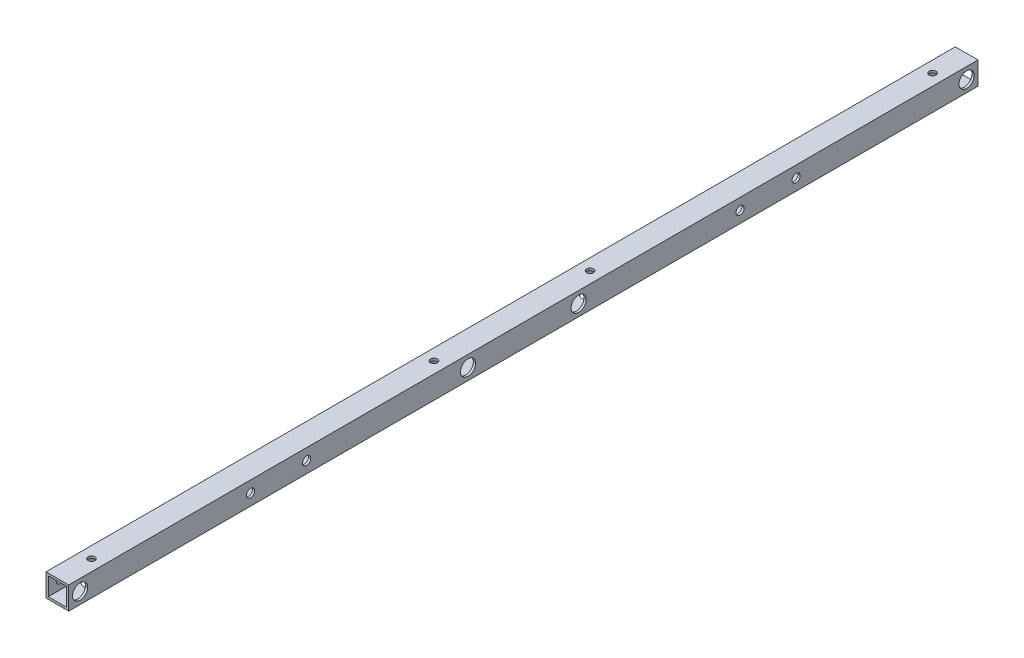
ISO-10303-21;
HEADER;
FILE_DESCRIPTION(('STEP AP214'),'2;1');
FILE_NAME('part.step','',(''),(''),'','','');
FILE_SCHEMA(('AUTOMOTIVE_DESIGN { 1 0 10303 214 1 1 1 1 }'));
ENDSEC;
DATA;
#1=APPLICATION_CONTEXT('core data for automotive mechanical design processes');
#2=APPLICATION_PROTOCOL_DEFINITION('international standard','automotive_design',2000,#1);
#3=PRODUCT_CONTEXT('',#1,'mechanical');
#4=PRODUCT('Part','Part','',(#3));
#5=PRODUCT_RELATED_PRODUCT_CATEGORY('part','',(#4));
#6=PRODUCT_DEFINITION_FORMATION('','',#4);
#7=PRODUCT_DEFINITION_CONTEXT('part definition',#1,'design');
#8=PRODUCT_DEFINITION('design','',#6,#7);
#9=PRODUCT_DEFINITION_SHAPE('','',#8);
#10=(LENGTH_UNIT() NAMED_UNIT(*) SI_UNIT(.MILLI.,.METRE.));
#11=(NAMED_UNIT(*) PLANE_ANGLE_UNIT() SI_UNIT($,.RADIAN.));
#12=(NAMED_UNIT(*) SI_UNIT($,.STERADIAN.) SOLID_ANGLE_UNIT());
#13=UNCERTAINTY_MEASURE_WITH_UNIT(LENGTH_MEASURE(1.E-05),#10,'distance_accuracy_value','');
#14=(GEOMETRIC_REPRESENTATION_CONTEXT(3) GLOBAL_UNCERTAINTY_ASSIGNED_CONTEXT((#13)) GLOBAL_UNIT_ASSIGNED_CONTEXT((#10,
#11,#12)) REPRESENTATION_CONTEXT('',''));
#15=CARTESIAN_POINT('',(0.,0.,0.));
#16=DIRECTION('',(0.,0.,1.));
#17=DIRECTION('',(1.,0.,0.));
#18=AXIS2_PLACEMENT_3D('',#15,#16,#17);
#19=CARTESIAN_POINT('',(0.,0.,600.));
#20=DIRECTION('',(0.,0.,-1.));
#21=DIRECTION('',(-1.,0.,0.));
#22=AXIS2_PLACEMENT_3D('',#19,#20,#21);
#23=PLANE('',#22);
#24=DIRECTION('',(0.,1.,0.));
#25=VECTOR('',#24,1.);
#26=CARTESIAN_POINT('',(7.5,-7.5,600.));
#27=LINE('',#26,#25);
#28=CARTESIAN_POINT('',(7.5,-7.5,600.));
#29=VERTEX_POINT('',#28);
#30=CARTESIAN_POINT('',(7.5,7.5,600.));
#31=VERTEX_POINT('',#30);
#32=EDGE_CURVE('E167',#29,#31,#27,.T.);
#33=ORIENTED_EDGE('',*,*,#32,.T.);
#34=DIRECTION('',(-1.,0.,0.));
#35=VECTOR('',#34,1.);
#36=CARTESIAN_POINT('',(-7.5,7.5,600.));
#37=LINE('',#36,#35);
#38=CARTESIAN_POINT('',(-7.5,7.5,600.));
#39=VERTEX_POINT('',#38);
#40=EDGE_CURVE('E171',#31,#39,#37,.T.);
#41=ORIENTED_EDGE('',*,*,#40,.T.);
#42=DIRECTION('',(0.,-1.,0.));
#43=VECTOR('',#42,1.);
#44=CARTESIAN_POINT('',(-7.5,-7.5,600.));
#45=LINE('',#44,#43);
#46=CARTESIAN_POINT('',(-7.5,-7.5,600.));
#47=VERTEX_POINT('',#46);
#48=EDGE_CURVE('E175',#39,#47,#45,.T.);
#49=ORIENTED_EDGE('',*,*,#48,.T.);
#50=DIRECTION('',(1.,0.,0.));
#51=VECTOR('',#50,1.);
#52=CARTESIAN_POINT('',(-7.5,-7.5,600.));
#53=LINE('',#52,#51);
#54=EDGE_CURVE('E178',#47,#29,#53,.T.);
#55=ORIENTED_EDGE('',*,*,#54,.T.);
#56=EDGE_LOOP('',(#33,#41,#49,#55));
#57=FACE_BOUND('',#56,.T.);
#58=DIRECTION('',(0.,1.,0.));
#59=VECTOR('',#58,1.);
#60=CARTESIAN_POINT('',(6.,-6.,600.));
#61=LINE('',#60,#59);
#62=CARTESIAN_POINT('',(6.,-6.,600.));
#63=VERTEX_POINT('',#62);
#64=CARTESIAN_POINT('',(6.,6.,600.));
#65=VERTEX_POINT('',#64);
#66=EDGE_CURVE('E115',#63,#65,#61,.T.);
#67=ORIENTED_EDGE('',*,*,#66,.F.);
#68=DIRECTION('',(1.,0.,0.));
#69=VECTOR('',#68,1.);
#70=CARTESIAN_POINT('',(-6.,-6.,600.));
#71=LINE('',#70,#69);
#72=CARTESIAN_POINT('',(-6.,-6.,600.));
#73=VERTEX_POINT('',#72);
#74=EDGE_CURVE('E143',#73,#63,#71,.T.);
#75=ORIENTED_EDGE('',*,*,#74,.F.);
#76=DIRECTION('',(0.,-1.,0.));
#77=VECTOR('',#76,1.);
#78=CARTESIAN_POINT('',(-6.,-6.,600.));
#79=LINE('',#78,#77);
#80=CARTESIAN_POINT('',(-6.,6.,600.));
#81=VERTEX_POINT('',#80);
#82=EDGE_CURVE('E137',#81,#73,#79,.T.);
#83=ORIENTED_EDGE('',*,*,#82,.F.);
#84=DIRECTION('',(-1.,0.,0.));
#85=VECTOR('',#84,1.);
#86=CARTESIAN_POINT('',(-6.,6.,600.));
#87=LINE('',#86,#85);
#88=EDGE_CURVE('E124',#65,#81,#87,.T.);
#89=ORIENTED_EDGE('',*,*,#88,.F.);
#90=EDGE_LOOP('',(#67,#75,#83,#89));
#91=FACE_BOUND('',#90,.T.);
#92=ADVANCED_FACE('F47',(#57,#91),#23,.F.);
#93=CARTESIAN_POINT('',(0.,0.,0.));
#94=DIRECTION('',(0.,0.,-1.));
#95=DIRECTION('',(-1.,0.,0.));
#96=AXIS2_PLACEMENT_3D('',#93,#94,#95);
#97=PLANE('',#96);
#98=DIRECTION('',(0.,1.,0.));
#99=VECTOR('',#98,1.);
#100=CARTESIAN_POINT('',(7.5,-7.5,0.));
#101=LINE('',#100,#99);
#102=CARTESIAN_POINT('',(7.5,-7.5,0.));
#103=VERTEX_POINT('',#102);
#104=CARTESIAN_POINT('',(7.5,7.5,0.));
#105=VERTEX_POINT('',#104);
#106=EDGE_CURVE('E133',#103,#105,#101,.T.);
#107=ORIENTED_EDGE('',*,*,#106,.F.);
#108=DIRECTION('',(1.,0.,0.));
#109=VECTOR('',#108,1.);
#110=CARTESIAN_POINT('',(-7.5,-7.5,0.));
#111=LINE('',#110,#109);
#112=CARTESIAN_POINT('',(-7.5,-7.5,0.));
#113=VERTEX_POINT('',#112);
#114=EDGE_CURVE('E172',#113,#103,#111,.T.);
#115=ORIENTED_EDGE('',*,*,#114,.F.);
#116=DIRECTION('',(0.,-1.,0.));
#117=VECTOR('',#116,1.);
#118=CARTESIAN_POINT('',(-7.5,-7.5,0.));
#119=LINE('',#118,#117);
#120=CARTESIAN_POINT('',(-7.5,7.5,0.));
#121=VERTEX_POINT('',#120);
#122=EDGE_CURVE('E188',#121,#113,#119,.T.);
#123=ORIENTED_EDGE('',*,*,#122,.F.);
#124=DIRECTION('',(-1.,0.,0.));
#125=VECTOR('',#124,1.);
#126=CARTESIAN_POINT('',(-7.5,7.5,0.));
#127=LINE('',#126,#125);
#128=EDGE_CURVE('E185',#105,#121,#127,.T.);
#129=ORIENTED_EDGE('',*,*,#128,.F.);
#130=EDGE_LOOP('',(#107,#115,#123,#129));
#131=FACE_BOUND('',#130,.T.);
#132=DIRECTION('',(1.,0.,0.));
#133=VECTOR('',#132,1.);
#134=CARTESIAN_POINT('',(-6.,-6.,0.));
#135=LINE('',#134,#133);
#136=CARTESIAN_POINT('',(-6.,-6.,0.));
#137=VERTEX_POINT('',#136);
#138=CARTESIAN_POINT('',(6.,-6.,0.));
#139=VERTEX_POINT('',#138);
#140=EDGE_CURVE('E125',#137,#139,#135,.T.);
#141=ORIENTED_EDGE('',*,*,#140,.T.);
#142=DIRECTION('',(0.,1.,0.));
#143=VECTOR('',#142,1.);
#144=CARTESIAN_POINT('',(6.,-6.,0.));
#145=LINE('',#144,#143);
#146=CARTESIAN_POINT('',(6.,6.,0.));
#147=VERTEX_POINT('',#146);
#148=EDGE_CURVE('E73',#139,#147,#145,.T.);
#149=ORIENTED_EDGE('',*,*,#148,.T.);
#150=DIRECTION('',(-1.,0.,0.));
#151=VECTOR('',#150,1.);
#152=CARTESIAN_POINT('',(-6.,6.,0.));
#153=LINE('',#152,#151);
#154=CARTESIAN_POINT('',(-6.,6.,0.));
#155=VERTEX_POINT('',#154);
#156=EDGE_CURVE('E131',#147,#155,#153,.T.);
#157=ORIENTED_EDGE('',*,*,#156,.T.);
#158=DIRECTION('',(0.,-1.,0.));
#159=VECTOR('',#158,1.);
#160=CARTESIAN_POINT('',(-6.,-6.,0.));
#161=LINE('',#160,#159);
#162=EDGE_CURVE('E154',#155,#137,#161,.T.);
#163=ORIENTED_EDGE('',*,*,#162,.T.);
#164=EDGE_LOOP('',(#141,#149,#157,#163));
#165=FACE_BOUND('',#164,.T.);
#166=ADVANCED_FACE('F404',(#131,#165),#97,.T.);
#167=CARTESIAN_POINT('',(7.5,-7.5,600.));
#168=DIRECTION('',(-1.,0.,0.));
#169=DIRECTION('',(0.,0.,1.));
#170=AXIS2_PLACEMENT_3D('',#167,#168,#169);
#171=PLANE('',#170);
#172=CARTESIAN_POINT('',(7.5,0.,120.));
#173=DIRECTION('',(-1.,0.,0.));
#174=DIRECTION('',(0.,0.,1.));
#175=AXIS2_PLACEMENT_3D('',#172,#173,#174);
#176=CIRCLE('',#175,2.7);
#177=CARTESIAN_POINT('',(7.5,0.,122.7));
#178=VERTEX_POINT('',#177);
#179=EDGE_CURVE('E299',#178,#178,#176,.T.);
#180=ORIENTED_EDGE('',*,*,#179,.T.);
#181=EDGE_LOOP('',(#180));
#182=FACE_BOUND('',#181,.T.);
#183=CARTESIAN_POINT('',(7.5,0.,157.));
#184=DIRECTION('',(-1.,0.,0.));
#185=DIRECTION('',(0.,0.,1.));
#186=AXIS2_PLACEMENT_3D('',#183,#184,#185);
#187=CIRCLE('',#186,2.7);
#188=CARTESIAN_POINT('',(7.5,0.,159.7));
#189=VERTEX_POINT('',#188);
#190=EDGE_CURVE('E290',#189,#189,#187,.T.);
#191=ORIENTED_EDGE('',*,*,#190,.T.);
#192=EDGE_LOOP('',(#191));
#193=FACE_BOUND('',#192,.T.);
#194=CARTESIAN_POINT('',(7.5,1.10883778837809E-12,443.));
#195=DIRECTION('',(-1.,0.,0.));
#196=DIRECTION('',(0.,0.,1.));
#197=AXIS2_PLACEMENT_3D('',#194,#195,#196);
#198=CIRCLE('',#197,2.69999999999999);
#199=CARTESIAN_POINT('',(7.5,1.10883778837809E-12,445.7));
#200=VERTEX_POINT('',#199);
#201=EDGE_CURVE('E282',#200,#200,#198,.T.);
#202=ORIENTED_EDGE('',*,*,#201,.T.);
#203=EDGE_LOOP('',(#202));
#204=FACE_BOUND('',#203,.T.);
#205=CARTESIAN_POINT('',(7.5,1.10883778837809E-12,480.));
#206=DIRECTION('',(-1.,0.,0.));
#207=DIRECTION('',(0.,0.,1.));
#208=AXIS2_PLACEMENT_3D('',#205,#206,#207);
#209=CIRCLE('',#208,2.69999999999999);
#210=CARTESIAN_POINT('',(7.5,1.10883778837809E-12,482.7));
#211=VERTEX_POINT('',#210);
#212=EDGE_CURVE('E275',#211,#211,#209,.T.);
#213=ORIENTED_EDGE('',*,*,#212,.T.);
#214=EDGE_LOOP('',(#213));
#215=FACE_BOUND('',#214,.T.);
#216=CARTESIAN_POINT('',(7.5,0.,592.5));
#217=DIRECTION('',(1.,0.,0.));
#218=DIRECTION('',(0.,0.,-1.));
#219=AXIS2_PLACEMENT_3D('',#216,#217,#218);
#220=CIRCLE('',#219,5.00000000000004);
#221=CARTESIAN_POINT('',(7.5,0.,587.5));
#222=VERTEX_POINT('',#221);
#223=EDGE_CURVE('E229',#222,#222,#220,.T.);
#224=ORIENTED_EDGE('',*,*,#223,.F.);
#225=EDGE_LOOP('',(#224));
#226=FACE_BOUND('',#225,.T.);
#227=CARTESIAN_POINT('',(7.5,0.,336.5));
#228=DIRECTION('',(1.,0.,0.));
#229=DIRECTION('',(0.,0.,-1.));
#230=AXIS2_PLACEMENT_3D('',#227,#228,#229);
#231=CIRCLE('',#230,4.99999999999999);
#232=CARTESIAN_POINT('',(7.5,0.,331.5));
#233=VERTEX_POINT('',#232);
#234=EDGE_CURVE('E329',#233,#233,#231,.T.);
#235=ORIENTED_EDGE('',*,*,#234,.F.);
#236=EDGE_LOOP('',(#235));
#237=FACE_BOUND('',#236,.T.);
#238=CARTESIAN_POINT('',(7.5,0.,263.5));
#239=DIRECTION('',(1.,0.,0.));
#240=DIRECTION('',(0.,0.,-1.));
#241=AXIS2_PLACEMENT_3D('',#238,#239,#240);
#242=CIRCLE('',#241,4.99999999999999);
#243=CARTESIAN_POINT('',(7.5,0.,258.5));
#244=VERTEX_POINT('',#243);
#245=EDGE_CURVE('E333',#244,#244,#242,.T.);
#246=ORIENTED_EDGE('',*,*,#245,.F.);
#247=EDGE_LOOP('',(#246));
#248=FACE_BOUND('',#247,.T.);
#249=CARTESIAN_POINT('',(7.5,0.,7.5));
#250=DIRECTION('',(1.,0.,0.));
#251=DIRECTION('',(0.,0.,-1.));
#252=AXIS2_PLACEMENT_3D('',#249,#250,#251);
#253=CIRCLE('',#252,5.);
#254=CARTESIAN_POINT('',(7.5,0.,2.5));
#255=VERTEX_POINT('',#254);
#256=EDGE_CURVE('E257',#255,#255,#253,.T.);
#257=ORIENTED_EDGE('',*,*,#256,.F.);
#258=EDGE_LOOP('',(#257));
#259=FACE_BOUND('',#258,.T.);
#260=ORIENTED_EDGE('',*,*,#106,.T.);
#261=DIRECTION('',(0.,0.,-1.));
#262=VECTOR('',#261,1.);
#263=CARTESIAN_POINT('',(7.5,7.5,600.));
#264=LINE('',#263,#262);
#265=EDGE_CURVE('E11',#31,#105,#264,.T.);
#266=ORIENTED_EDGE('',*,*,#265,.F.);
#267=ORIENTED_EDGE('',*,*,#32,.F.);
#268=DIRECTION('',(0.,0.,-1.));
#269=VECTOR('',#268,1.);
#270=CARTESIAN_POINT('',(7.5,-7.5,600.));
#271=LINE('',#270,#269);
#272=EDGE_CURVE('E181',#29,#103,#271,.T.);
#273=ORIENTED_EDGE('',*,*,#272,.T.);
#274=EDGE_LOOP('',(#260,#266,#267,#273));
#275=FACE_BOUND('',#274,.T.);
#276=ADVANCED_FACE('F49',(#182,#193,#204,#215,#226,#237,#248,#259,#275),#171,.F.);
#277=CARTESIAN_POINT('',(-7.5,7.5,600.));
#278=DIRECTION('',(0.,-1.,0.));
#279=DIRECTION('',(0.,0.,-1.));
#280=AXIS2_PLACEMENT_3D('',#277,#278,#279);
#281=PLANE('',#280);
#282=CARTESIAN_POINT('',(0.,7.5,577.5));
#283=DIRECTION('',(0.,1.,0.));
#284=DIRECTION('',(0.,0.,1.));
#285=AXIS2_PLACEMENT_3D('',#282,#283,#284);
#286=CIRCLE('',#285,2.24999999999998);
#287=CARTESIAN_POINT('',(0.,7.5,579.75));
#288=VERTEX_POINT('',#287);
#289=EDGE_CURVE('E346',#288,#288,#286,.T.);
#290=ORIENTED_EDGE('',*,*,#289,.F.);
#291=EDGE_LOOP('',(#290));
#292=FACE_BOUND('',#291,.T.);
#293=CARTESIAN_POINT('',(0.,7.5,22.5));
#294=DIRECTION('',(0.,1.,0.));
#295=DIRECTION('',(0.,0.,1.));
#296=AXIS2_PLACEMENT_3D('',#293,#294,#295);
#297=CIRCLE('',#296,2.25);
#298=CARTESIAN_POINT('',(0.,7.5,24.75));
#299=VERTEX_POINT('',#298);
#300=EDGE_CURVE('E352',#299,#299,#297,.T.);
#301=ORIENTED_EDGE('',*,*,#300,.F.);
#302=EDGE_LOOP('',(#301));
#303=FACE_BOUND('',#302,.T.);
#304=CARTESIAN_POINT('',(0.,7.5,351.5));
#305=DIRECTION('',(0.,1.,0.));
#306=DIRECTION('',(0.,0.,1.));
#307=AXIS2_PLACEMENT_3D('',#304,#305,#306);
#308=CIRCLE('',#307,2.25);
#309=CARTESIAN_POINT('',(0.,7.5,353.75));
#310=VERTEX_POINT('',#309);
#311=EDGE_CURVE('E347',#310,#310,#308,.T.);
#312=ORIENTED_EDGE('',*,*,#311,.F.);
#313=EDGE_LOOP('',(#312));
#314=FACE_BOUND('',#313,.T.);
#315=CARTESIAN_POINT('',(0.,7.5,248.5));
#316=DIRECTION('',(0.,1.,0.));
#317=DIRECTION('',(0.,0.,1.));
#318=AXIS2_PLACEMENT_3D('',#315,#316,#317);
#319=CIRCLE('',#318,2.25);
#320=CARTESIAN_POINT('',(0.,7.5,250.75));
#321=VERTEX_POINT('',#320);
#322=EDGE_CURVE('E351',#321,#321,#319,.T.);
#323=ORIENTED_EDGE('',*,*,#322,.F.);
#324=EDGE_LOOP('',(#323));
#325=FACE_BOUND('',#324,.T.);
#326=ORIENTED_EDGE('',*,*,#128,.T.);
#327=DIRECTION('',(0.,0.,-1.));
#328=VECTOR('',#327,1.);
#329=CARTESIAN_POINT('',(-7.5,7.5,600.));
#330=LINE('',#329,#328);
#331=EDGE_CURVE('E57',#39,#121,#330,.T.);
#332=ORIENTED_EDGE('',*,*,#331,.F.);
#333=ORIENTED_EDGE('',*,*,#40,.F.);
#334=ORIENTED_EDGE('',*,*,#265,.T.);
#335=EDGE_LOOP('',(#326,#332,#333,#334));
#336=FACE_BOUND('',#335,.T.);
#337=ADVANCED_FACE('F419',(#292,#303,#314,#325,#336),#281,.F.);
#338=CARTESIAN_POINT('',(-7.5,-7.5,600.));
#339=DIRECTION('',(1.,0.,0.));
#340=DIRECTION('',(0.,0.,-1.));
#341=AXIS2_PLACEMENT_3D('',#338,#339,#340);
#342=PLANE('',#341);
#343=CARTESIAN_POINT('',(-7.5,0.,120.));
#344=DIRECTION('',(-1.,0.,0.));
#345=DIRECTION('',(0.,0.,1.));
#346=AXIS2_PLACEMENT_3D('',#343,#344,#345);
#347=CIRCLE('',#346,5.);
#348=CARTESIAN_POINT('',(-7.5,0.,125.));
#349=VERTEX_POINT('',#348);
#350=EDGE_CURVE('E263',#349,#349,#347,.T.);
#351=ORIENTED_EDGE('',*,*,#350,.F.);
#352=EDGE_LOOP('',(#351));
#353=FACE_BOUND('',#352,.T.);
#354=CARTESIAN_POINT('',(-7.5,0.,157.));
#355=DIRECTION('',(-1.,0.,0.));
#356=DIRECTION('',(0.,0.,1.));
#357=AXIS2_PLACEMENT_3D('',#354,#355,#356);
#358=CIRCLE('',#357,4.99999999999999);
#359=CARTESIAN_POINT('',(-7.5,0.,162.));
#360=VERTEX_POINT('',#359);
#361=EDGE_CURVE('E577',#360,#360,#358,.T.);
#362=ORIENTED_EDGE('',*,*,#361,.F.);
#363=EDGE_LOOP('',(#362));
#364=FACE_BOUND('',#363,.T.);
#365=CARTESIAN_POINT('',(-7.5,1.10883778837809E-12,443.));
#366=DIRECTION('',(-1.,0.,0.));
#367=DIRECTION('',(0.,0.,1.));
#368=AXIS2_PLACEMENT_3D('',#365,#366,#367);
#369=CIRCLE('',#368,4.99999999999999);
#370=CARTESIAN_POINT('',(-7.5,1.10883778837809E-12,448.));
#371=VERTEX_POINT('',#370);
#372=EDGE_CURVE('E583',#371,#371,#369,.T.);
#373=ORIENTED_EDGE('',*,*,#372,.F.);
#374=EDGE_LOOP('',(#373));
#375=FACE_BOUND('',#374,.T.);
#376=CARTESIAN_POINT('',(-7.5,1.10883778837809E-12,480.));
#377=DIRECTION('',(-1.,0.,0.));
#378=DIRECTION('',(0.,0.,1.));
#379=AXIS2_PLACEMENT_3D('',#376,#377,#378);
#380=CIRCLE('',#379,4.99999999999999);
#381=CARTESIAN_POINT('',(-7.5,1.10883778837809E-12,485.));
#382=VERTEX_POINT('',#381);
#383=EDGE_CURVE('E589',#382,#382,#380,.T.);
#384=ORIENTED_EDGE('',*,*,#383,.F.);
#385=EDGE_LOOP('',(#384));
#386=FACE_BOUND('',#385,.T.);
#387=CARTESIAN_POINT('',(-7.5,0.,336.5));
#388=DIRECTION('',(1.,0.,0.));
#389=DIRECTION('',(0.,0.,-1.));
#390=AXIS2_PLACEMENT_3D('',#387,#388,#389);
#391=CIRCLE('',#390,2.24999999999995);
#392=CARTESIAN_POINT('',(-7.5,0.,334.25));
#393=VERTEX_POINT('',#392);
#394=EDGE_CURVE('E223',#393,#393,#391,.T.);
#395=ORIENTED_EDGE('',*,*,#394,.T.);
#396=EDGE_LOOP('',(#395));
#397=FACE_BOUND('',#396,.T.);
#398=CARTESIAN_POINT('',(-7.5,0.,263.5));
#399=DIRECTION('',(1.,0.,0.));
#400=DIRECTION('',(0.,0.,-1.));
#401=AXIS2_PLACEMENT_3D('',#398,#399,#400);
#402=CIRCLE('',#401,2.24999999999995);
#403=CARTESIAN_POINT('',(-7.5,0.,261.25));
#404=VERTEX_POINT('',#403);
#405=EDGE_CURVE('E217',#404,#404,#402,.T.);
#406=ORIENTED_EDGE('',*,*,#405,.T.);
#407=EDGE_LOOP('',(#406));
#408=FACE_BOUND('',#407,.T.);
#409=CARTESIAN_POINT('',(-7.5,0.,592.5));
#410=DIRECTION('',(1.,0.,0.));
#411=DIRECTION('',(0.,0.,-1.));
#412=AXIS2_PLACEMENT_3D('',#409,#410,#411);
#413=CIRCLE('',#412,2.25000000000001);
#414=CARTESIAN_POINT('',(-7.5,0.,590.25));
#415=VERTEX_POINT('',#414);
#416=EDGE_CURVE('E151',#415,#415,#413,.T.);
#417=ORIENTED_EDGE('',*,*,#416,.T.);
#418=EDGE_LOOP('',(#417));
#419=FACE_BOUND('',#418,.T.);
#420=CARTESIAN_POINT('',(-7.5,0.,7.5));
#421=DIRECTION('',(1.,0.,0.));
#422=DIRECTION('',(0.,0.,-1.));
#423=AXIS2_PLACEMENT_3D('',#420,#421,#422);
#424=CIRCLE('',#423,2.25);
#425=CARTESIAN_POINT('',(-7.5,0.,5.25));
#426=VERTEX_POINT('',#425);
#427=EDGE_CURVE('E207',#426,#426,#424,.T.);
#428=ORIENTED_EDGE('',*,*,#427,.T.);
#429=EDGE_LOOP('',(#428));
#430=FACE_BOUND('',#429,.T.);
#431=ORIENTED_EDGE('',*,*,#122,.T.);
#432=DIRECTION('',(0.,0.,-1.));
#433=VECTOR('',#432,1.);
#434=CARTESIAN_POINT('',(-7.5,-7.5,600.));
#435=LINE('',#434,#433);
#436=EDGE_CURVE('E196',#47,#113,#435,.T.);
#437=ORIENTED_EDGE('',*,*,#436,.F.);
#438=ORIENTED_EDGE('',*,*,#48,.F.);
#439=ORIENTED_EDGE('',*,*,#331,.T.);
#440=EDGE_LOOP('',(#431,#437,#438,#439));
#441=FACE_BOUND('',#440,.T.);
#442=ADVANCED_FACE('F385',(#353,#364,#375,#386,#397,#408,#419,#430,#441),#342,.F.);
#443=CARTESIAN_POINT('',(-7.5,-7.5,600.));
#444=DIRECTION('',(0.,1.,0.));
#445=DIRECTION('',(0.,0.,1.));
#446=AXIS2_PLACEMENT_3D('',#443,#444,#445);
#447=PLANE('',#446);
#448=CARTESIAN_POINT('',(0.,-7.5,577.5));
#449=DIRECTION('',(0.,-1.,0.));
#450=DIRECTION('',(0.,0.,-1.));
#451=AXIS2_PLACEMENT_3D('',#448,#449,#450);
#452=CIRCLE('',#451,5.);
#453=CARTESIAN_POINT('',(0.,-7.5,572.5));
#454=VERTEX_POINT('',#453);
#455=EDGE_CURVE('E245',#454,#454,#452,.T.);
#456=ORIENTED_EDGE('',*,*,#455,.F.);
#457=EDGE_LOOP('',(#456));
#458=FACE_BOUND('',#457,.T.);
#459=CARTESIAN_POINT('',(0.,-7.5,22.5));
#460=DIRECTION('',(0.,-1.,0.));
#461=DIRECTION('',(0.,0.,-1.));
#462=AXIS2_PLACEMENT_3D('',#459,#460,#461);
#463=CIRCLE('',#462,5.);
#464=CARTESIAN_POINT('',(0.,-7.5,17.5));
#465=VERTEX_POINT('',#464);
#466=EDGE_CURVE('E315',#465,#465,#463,.T.);
#467=ORIENTED_EDGE('',*,*,#466,.F.);
#468=EDGE_LOOP('',(#467));
#469=FACE_BOUND('',#468,.T.);
#470=CARTESIAN_POINT('',(0.,-7.5,248.5));
#471=DIRECTION('',(0.,-1.,0.));
#472=DIRECTION('',(0.,0.,-1.));
#473=AXIS2_PLACEMENT_3D('',#470,#471,#472);
#474=CIRCLE('',#473,5.);
#475=CARTESIAN_POINT('',(0.,-7.5,243.5));
#476=VERTEX_POINT('',#475);
#477=EDGE_CURVE('E319',#476,#476,#474,.T.);
#478=ORIENTED_EDGE('',*,*,#477,.F.);
#479=EDGE_LOOP('',(#478));
#480=FACE_BOUND('',#479,.T.);
#481=CARTESIAN_POINT('',(0.,-7.5,351.5));
#482=DIRECTION('',(0.,-1.,0.));
#483=DIRECTION('',(0.,0.,-1.));
#484=AXIS2_PLACEMENT_3D('',#481,#482,#483);
#485=CIRCLE('',#484,5.);
#486=CARTESIAN_POINT('',(0.,-7.5,346.5));
#487=VERTEX_POINT('',#486);
#488=EDGE_CURVE('E311',#487,#487,#485,.T.);
#489=ORIENTED_EDGE('',*,*,#488,.F.);
#490=EDGE_LOOP('',(#489));
#491=FACE_BOUND('',#490,.T.);
#492=ORIENTED_EDGE('',*,*,#114,.T.);
#493=ORIENTED_EDGE('',*,*,#272,.F.);
#494=ORIENTED_EDGE('',*,*,#54,.F.);
#495=ORIENTED_EDGE('',*,*,#436,.T.);
#496=EDGE_LOOP('',(#492,#493,#494,#495));
#497=FACE_BOUND('',#496,.T.);
#498=ADVANCED_FACE('F414',(#458,#469,#480,#491,#497),#447,.F.);
#499=CARTESIAN_POINT('',(6.,-6.,600.));
#500=DIRECTION('',(-1.,0.,0.));
#501=DIRECTION('',(0.,0.,1.));
#502=AXIS2_PLACEMENT_3D('',#499,#500,#501);
#503=PLANE('',#502);
#504=CARTESIAN_POINT('',(6.,0.,120.));
#505=DIRECTION('',(-1.,0.,0.));
#506=DIRECTION('',(0.,0.,1.));
#507=AXIS2_PLACEMENT_3D('',#504,#505,#506);
#508=CIRCLE('',#507,2.7);
#509=CARTESIAN_POINT('',(6.,0.,122.7));
#510=VERTEX_POINT('',#509);
#511=EDGE_CURVE('E307',#510,#510,#508,.F.);
#512=ORIENTED_EDGE('',*,*,#511,.T.);
#513=EDGE_LOOP('',(#512));
#514=FACE_BOUND('',#513,.T.);
#515=CARTESIAN_POINT('',(6.,0.,157.));
#516=DIRECTION('',(-1.,0.,0.));
#517=DIRECTION('',(0.,0.,1.));
#518=AXIS2_PLACEMENT_3D('',#515,#516,#517);
#519=CIRCLE('',#518,2.7);
#520=CARTESIAN_POINT('',(6.,0.,159.7));
#521=VERTEX_POINT('',#520);
#522=EDGE_CURVE('E303',#521,#521,#519,.F.);
#523=ORIENTED_EDGE('',*,*,#522,.T.);
#524=EDGE_LOOP('',(#523));
#525=FACE_BOUND('',#524,.T.);
#526=CARTESIAN_POINT('',(6.,1.10883778837809E-12,443.));
#527=DIRECTION('',(-1.,0.,0.));
#528=DIRECTION('',(0.,0.,1.));
#529=AXIS2_PLACEMENT_3D('',#526,#527,#528);
#530=CIRCLE('',#529,2.69999999999999);
#531=CARTESIAN_POINT('',(6.,1.10883778837809E-12,445.7));
#532=VERTEX_POINT('',#531);
#533=EDGE_CURVE('E298',#532,#532,#530,.F.);
#534=ORIENTED_EDGE('',*,*,#533,.T.);
#535=EDGE_LOOP('',(#534));
#536=FACE_BOUND('',#535,.T.);
#537=CARTESIAN_POINT('',(6.,1.10883778837809E-12,480.));
#538=DIRECTION('',(-1.,0.,0.));
#539=DIRECTION('',(0.,0.,1.));
#540=AXIS2_PLACEMENT_3D('',#537,#538,#539);
#541=CIRCLE('',#540,2.69999999999999);
#542=CARTESIAN_POINT('',(6.,1.10883778837809E-12,482.7));
#543=VERTEX_POINT('',#542);
#544=EDGE_CURVE('E294',#543,#543,#541,.F.);
#545=ORIENTED_EDGE('',*,*,#544,.T.);
#546=EDGE_LOOP('',(#545));
#547=FACE_BOUND('',#546,.T.);
#548=CARTESIAN_POINT('',(6.,0.,592.5));
#549=DIRECTION('',(-1.,0.,0.));
#550=DIRECTION('',(0.,0.,1.));
#551=AXIS2_PLACEMENT_3D('',#548,#549,#550);
#552=CIRCLE('',#551,5.00000000000004);
#553=CARTESIAN_POINT('',(6.,0.,597.5));
#554=VERTEX_POINT('',#553);
#555=EDGE_CURVE('E218',#554,#554,#552,.T.);
#556=ORIENTED_EDGE('',*,*,#555,.F.);
#557=EDGE_LOOP('',(#556));
#558=FACE_BOUND('',#557,.T.);
#559=CARTESIAN_POINT('',(6.,0.,336.5));
#560=DIRECTION('',(-1.,0.,0.));
#561=DIRECTION('',(0.,0.,1.));
#562=AXIS2_PLACEMENT_3D('',#559,#560,#561);
#563=CIRCLE('',#562,4.99999999999999);
#564=CARTESIAN_POINT('',(6.,0.,341.5));
#565=VERTEX_POINT('',#564);
#566=EDGE_CURVE('E233',#565,#565,#563,.T.);
#567=ORIENTED_EDGE('',*,*,#566,.F.);
#568=EDGE_LOOP('',(#567));
#569=FACE_BOUND('',#568,.T.);
#570=CARTESIAN_POINT('',(6.,0.,263.5));
#571=DIRECTION('',(-1.,0.,0.));
#572=DIRECTION('',(0.,0.,1.));
#573=AXIS2_PLACEMENT_3D('',#570,#571,#572);
#574=CIRCLE('',#573,4.99999999999999);
#575=CARTESIAN_POINT('',(6.,0.,268.5));
#576=VERTEX_POINT('',#575);
#577=EDGE_CURVE('E228',#576,#576,#574,.T.);
#578=ORIENTED_EDGE('',*,*,#577,.F.);
#579=EDGE_LOOP('',(#578));
#580=FACE_BOUND('',#579,.T.);
#581=CARTESIAN_POINT('',(6.,0.,7.5));
#582=DIRECTION('',(-1.,0.,0.));
#583=DIRECTION('',(0.,0.,1.));
#584=AXIS2_PLACEMENT_3D('',#581,#582,#583);
#585=CIRCLE('',#584,5.);
#586=CARTESIAN_POINT('',(6.,0.,12.5));
#587=VERTEX_POINT('',#586);
#588=EDGE_CURVE('E224',#587,#587,#585,.T.);
#589=ORIENTED_EDGE('',*,*,#588,.F.);
#590=EDGE_LOOP('',(#589));
#591=FACE_BOUND('',#590,.T.);
#592=ORIENTED_EDGE('',*,*,#148,.F.);
#593=DIRECTION('',(0.,0.,-1.));
#594=VECTOR('',#593,1.);
#595=CARTESIAN_POINT('',(6.,-6.,600.));
#596=LINE('',#595,#594);
#597=EDGE_CURVE('E119',#63,#139,#596,.T.);
#598=ORIENTED_EDGE('',*,*,#597,.F.);
#599=ORIENTED_EDGE('',*,*,#66,.T.);
#600=DIRECTION('',(0.,0.,-1.));
#601=VECTOR('',#600,1.);
#602=CARTESIAN_POINT('',(6.,6.,600.));
#603=LINE('',#602,#601);
#604=EDGE_CURVE('E118',#65,#147,#603,.T.);
#605=ORIENTED_EDGE('',*,*,#604,.T.);
#606=EDGE_LOOP('',(#592,#598,#599,#605));
#607=FACE_BOUND('',#606,.T.);
#608=ADVANCED_FACE('F117',(#514,#525,#536,#547,#558,#569,#580,#591,#607),#503,.T.);
#609=CARTESIAN_POINT('',(-6.,6.,600.));
#610=DIRECTION('',(0.,-1.,0.));
#611=DIRECTION('',(0.,0.,-1.));
#612=AXIS2_PLACEMENT_3D('',#609,#610,#611);
#613=PLANE('',#612);
#614=CARTESIAN_POINT('',(0.,6.,577.5));
#615=DIRECTION('',(0.,-1.,0.));
#616=DIRECTION('',(0.,0.,-1.));
#617=AXIS2_PLACEMENT_3D('',#614,#615,#616);
#618=CIRCLE('',#617,2.24999999999998);
#619=CARTESIAN_POINT('',(0.,6.,575.25));
#620=VERTEX_POINT('',#619);
#621=EDGE_CURVE('E208',#620,#620,#618,.T.);
#622=ORIENTED_EDGE('',*,*,#621,.F.);
#623=EDGE_LOOP('',(#622));
#624=FACE_BOUND('',#623,.T.);
#625=CARTESIAN_POINT('',(0.,6.,22.5));
#626=DIRECTION('',(0.,-1.,0.));
#627=DIRECTION('',(0.,0.,-1.));
#628=AXIS2_PLACEMENT_3D('',#625,#626,#627);
#629=CIRCLE('',#628,2.25);
#630=CARTESIAN_POINT('',(0.,6.,20.25));
#631=VERTEX_POINT('',#630);
#632=EDGE_CURVE('E370',#631,#631,#629,.T.);
#633=ORIENTED_EDGE('',*,*,#632,.F.);
#634=EDGE_LOOP('',(#633));
#635=FACE_BOUND('',#634,.T.);
#636=CARTESIAN_POINT('',(0.,6.,351.5));
#637=DIRECTION('',(0.,-1.,0.));
#638=DIRECTION('',(0.,0.,-1.));
#639=AXIS2_PLACEMENT_3D('',#636,#637,#638);
#640=CIRCLE('',#639,2.25);
#641=CARTESIAN_POINT('',(0.,6.,349.25));
#642=VERTEX_POINT('',#641);
#643=EDGE_CURVE('E366',#642,#642,#640,.T.);
#644=ORIENTED_EDGE('',*,*,#643,.F.);
#645=EDGE_LOOP('',(#644));
#646=FACE_BOUND('',#645,.T.);
#647=CARTESIAN_POINT('',(0.,6.,248.5));
#648=DIRECTION('',(0.,-1.,0.));
#649=DIRECTION('',(0.,0.,-1.));
#650=AXIS2_PLACEMENT_3D('',#647,#648,#649);
#651=CIRCLE('',#650,2.25);
#652=CARTESIAN_POINT('',(0.,6.,246.25));
#653=VERTEX_POINT('',#652);
#654=EDGE_CURVE('E362',#653,#653,#651,.T.);
#655=ORIENTED_EDGE('',*,*,#654,.F.);
#656=EDGE_LOOP('',(#655));
#657=FACE_BOUND('',#656,.T.);
#658=ORIENTED_EDGE('',*,*,#156,.F.);
#659=ORIENTED_EDGE('',*,*,#604,.F.);
#660=ORIENTED_EDGE('',*,*,#88,.T.);
#661=DIRECTION('',(0.,0.,-1.));
#662=VECTOR('',#661,1.);
#663=CARTESIAN_POINT('',(-6.,6.,600.));
#664=LINE('',#663,#662);
#665=EDGE_CURVE('E134',#81,#155,#664,.T.);
#666=ORIENTED_EDGE('',*,*,#665,.T.);
#667=EDGE_LOOP('',(#658,#659,#660,#666));
#668=FACE_BOUND('',#667,.T.);
#669=ADVANCED_FACE('F128',(#624,#635,#646,#657,#668),#613,.T.);
#670=CARTESIAN_POINT('',(-6.,-6.,600.));
#671=DIRECTION('',(1.,0.,0.));
#672=DIRECTION('',(0.,0.,-1.));
#673=AXIS2_PLACEMENT_3D('',#670,#671,#672);
#674=PLANE('',#673);
#675=CARTESIAN_POINT('',(-6.,0.,120.));
#676=DIRECTION('',(1.,0.,0.));
#677=DIRECTION('',(0.,0.,-1.));
#678=AXIS2_PLACEMENT_3D('',#675,#676,#677);
#679=CIRCLE('',#678,5.);
#680=CARTESIAN_POINT('',(-6.,0.,115.));
#681=VERTEX_POINT('',#680);
#682=EDGE_CURVE('E51',#681,#681,#679,.T.);
#683=ORIENTED_EDGE('',*,*,#682,.F.);
#684=EDGE_LOOP('',(#683));
#685=FACE_BOUND('',#684,.T.);
#686=CARTESIAN_POINT('',(-6.,0.,157.));
#687=DIRECTION('',(1.,0.,0.));
#688=DIRECTION('',(0.,0.,-1.));
#689=AXIS2_PLACEMENT_3D('',#686,#687,#688);
#690=CIRCLE('',#689,4.99999999999999);
#691=CARTESIAN_POINT('',(-6.,0.,152.));
#692=VERTEX_POINT('',#691);
#693=EDGE_CURVE('E266',#692,#692,#690,.T.);
#694=ORIENTED_EDGE('',*,*,#693,.F.);
#695=EDGE_LOOP('',(#694));
#696=FACE_BOUND('',#695,.T.);
#697=CARTESIAN_POINT('',(-6.,1.10883778837809E-12,443.));
#698=DIRECTION('',(1.,0.,0.));
#699=DIRECTION('',(0.,0.,-1.));
#700=AXIS2_PLACEMENT_3D('',#697,#698,#699);
#701=CIRCLE('',#700,4.99999999999999);
#702=CARTESIAN_POINT('',(-6.,1.10883778837809E-12,438.));
#703=VERTEX_POINT('',#702);
#704=EDGE_CURVE('E262',#703,#703,#701,.T.);
#705=ORIENTED_EDGE('',*,*,#704,.F.);
#706=EDGE_LOOP('',(#705));
#707=FACE_BOUND('',#706,.T.);
#708=CARTESIAN_POINT('',(-6.,1.10883778837809E-12,480.));
#709=DIRECTION('',(1.,0.,0.));
#710=DIRECTION('',(0.,0.,-1.));
#711=AXIS2_PLACEMENT_3D('',#708,#709,#710);
#712=CIRCLE('',#711,4.99999999999999);
#713=CARTESIAN_POINT('',(-6.,1.10883778837809E-12,475.));
#714=VERTEX_POINT('',#713);
#715=EDGE_CURVE('E258',#714,#714,#712,.T.);
#716=ORIENTED_EDGE('',*,*,#715,.F.);
#717=EDGE_LOOP('',(#716));
#718=FACE_BOUND('',#717,.T.);
#719=CARTESIAN_POINT('',(-6.,0.,336.5));
#720=DIRECTION('',(1.,0.,0.));
#721=DIRECTION('',(0.,0.,-1.));
#722=AXIS2_PLACEMENT_3D('',#719,#720,#721);
#723=CIRCLE('',#722,2.24999999999995);
#724=CARTESIAN_POINT('',(-6.,0.,334.25));
#725=VERTEX_POINT('',#724);
#726=EDGE_CURVE('E219',#725,#725,#723,.T.);
#727=ORIENTED_EDGE('',*,*,#726,.F.);
#728=EDGE_LOOP('',(#727));
#729=FACE_BOUND('',#728,.T.);
#730=CARTESIAN_POINT('',(-6.,0.,263.5));
#731=DIRECTION('',(1.,0.,0.));
#732=DIRECTION('',(0.,0.,-1.));
#733=AXIS2_PLACEMENT_3D('',#730,#731,#732);
#734=CIRCLE('',#733,2.24999999999995);
#735=CARTESIAN_POINT('',(-6.,0.,261.25));
#736=VERTEX_POINT('',#735);
#737=EDGE_CURVE('E213',#736,#736,#734,.T.);
#738=ORIENTED_EDGE('',*,*,#737,.F.);
#739=EDGE_LOOP('',(#738));
#740=FACE_BOUND('',#739,.T.);
#741=CARTESIAN_POINT('',(-6.,0.,592.5));
#742=DIRECTION('',(1.,0.,0.));
#743=DIRECTION('',(0.,0.,-1.));
#744=AXIS2_PLACEMENT_3D('',#741,#742,#743);
#745=CIRCLE('',#744,2.25000000000001);
#746=CARTESIAN_POINT('',(-6.,0.,590.25));
#747=VERTEX_POINT('',#746);
#748=EDGE_CURVE('E209',#747,#747,#745,.T.);
#749=ORIENTED_EDGE('',*,*,#748,.F.);
#750=EDGE_LOOP('',(#749));
#751=FACE_BOUND('',#750,.T.);
#752=CARTESIAN_POINT('',(-6.,0.,7.5));
#753=DIRECTION('',(1.,0.,0.));
#754=DIRECTION('',(0.,0.,-1.));
#755=AXIS2_PLACEMENT_3D('',#752,#753,#754);
#756=CIRCLE('',#755,2.25);
#757=CARTESIAN_POINT('',(-6.,0.,5.25));
#758=VERTEX_POINT('',#757);
#759=EDGE_CURVE('E203',#758,#758,#756,.T.);
#760=ORIENTED_EDGE('',*,*,#759,.F.);
#761=EDGE_LOOP('',(#760));
#762=FACE_BOUND('',#761,.T.);
#763=ORIENTED_EDGE('',*,*,#162,.F.);
#764=ORIENTED_EDGE('',*,*,#665,.F.);
#765=ORIENTED_EDGE('',*,*,#82,.T.);
#766=DIRECTION('',(0.,0.,-1.));
#767=VECTOR('',#766,1.);
#768=CARTESIAN_POINT('',(-6.,-6.,600.));
#769=LINE('',#768,#767);
#770=EDGE_CURVE('E65',#73,#137,#769,.T.);
#771=ORIENTED_EDGE('',*,*,#770,.T.);
#772=EDGE_LOOP('',(#763,#764,#765,#771));
#773=FACE_BOUND('',#772,.T.);
#774=ADVANCED_FACE('F450',(#685,#696,#707,#718,#729,#740,#751,#762,#773),#674,.T.);
#775=CARTESIAN_POINT('',(-6.,-6.,600.));
#776=DIRECTION('',(0.,1.,0.));
#777=DIRECTION('',(0.,0.,1.));
#778=AXIS2_PLACEMENT_3D('',#775,#776,#777);
#779=PLANE('',#778);
#780=CARTESIAN_POINT('',(0.,-6.,577.5));
#781=DIRECTION('',(0.,1.,0.));
#782=DIRECTION('',(0.,0.,1.));
#783=AXIS2_PLACEMENT_3D('',#780,#781,#782);
#784=CIRCLE('',#783,5.);
#785=CARTESIAN_POINT('',(0.,-6.,582.5));
#786=VERTEX_POINT('',#785);
#787=EDGE_CURVE('E253',#786,#786,#784,.T.);
#788=ORIENTED_EDGE('',*,*,#787,.F.);
#789=EDGE_LOOP('',(#788));
#790=FACE_BOUND('',#789,.T.);
#791=CARTESIAN_POINT('',(0.,-6.,22.5));
#792=DIRECTION('',(0.,1.,0.));
#793=DIRECTION('',(0.,0.,1.));
#794=AXIS2_PLACEMENT_3D('',#791,#792,#793);
#795=CIRCLE('',#794,5.);
#796=CARTESIAN_POINT('',(0.,-6.,27.5));
#797=VERTEX_POINT('',#796);
#798=EDGE_CURVE('E249',#797,#797,#795,.T.);
#799=ORIENTED_EDGE('',*,*,#798,.F.);
#800=EDGE_LOOP('',(#799));
#801=FACE_BOUND('',#800,.T.);
#802=CARTESIAN_POINT('',(0.,-6.,248.5));
#803=DIRECTION('',(0.,1.,0.));
#804=DIRECTION('',(0.,0.,1.));
#805=AXIS2_PLACEMENT_3D('',#802,#803,#804);
#806=CIRCLE('',#805,5.);
#807=CARTESIAN_POINT('',(0.,-6.,253.5));
#808=VERTEX_POINT('',#807);
#809=EDGE_CURVE('E244',#808,#808,#806,.T.);
#810=ORIENTED_EDGE('',*,*,#809,.F.);
#811=EDGE_LOOP('',(#810));
#812=FACE_BOUND('',#811,.T.);
#813=CARTESIAN_POINT('',(0.,-6.,351.5));
#814=DIRECTION('',(0.,1.,0.));
#815=DIRECTION('',(0.,0.,1.));
#816=AXIS2_PLACEMENT_3D('',#813,#814,#815);
#817=CIRCLE('',#816,5.);
#818=CARTESIAN_POINT('',(0.,-6.,356.5));
#819=VERTEX_POINT('',#818);
#820=EDGE_CURVE('E240',#819,#819,#817,.T.);
#821=ORIENTED_EDGE('',*,*,#820,.F.);
#822=EDGE_LOOP('',(#821));
#823=FACE_BOUND('',#822,.T.);
#824=ORIENTED_EDGE('',*,*,#140,.F.);
#825=ORIENTED_EDGE('',*,*,#770,.F.);
#826=ORIENTED_EDGE('',*,*,#74,.T.);
#827=ORIENTED_EDGE('',*,*,#597,.T.);
#828=EDGE_LOOP('',(#824,#825,#826,#827));
#829=FACE_BOUND('',#828,.T.);
#830=ADVANCED_FACE('F400',(#790,#801,#812,#823,#829),#779,.T.);
#831=CARTESIAN_POINT('',(-17.5,0.,7.5));
#832=DIRECTION('',(1.,0.,0.));
#833=DIRECTION('',(0.,0.,-1.));
#834=AXIS2_PLACEMENT_3D('',#831,#832,#833);
#835=CYLINDRICAL_SURFACE('',#834,2.25);
#836=ORIENTED_EDGE('',*,*,#759,.T.);
#837=EDGE_LOOP('',(#836));
#838=FACE_BOUND('',#837,.T.);
#839=ORIENTED_EDGE('',*,*,#427,.F.);
#840=EDGE_LOOP('',(#839));
#841=FACE_BOUND('',#840,.T.);
#842=ADVANCED_FACE('F391',(#838,#841),#835,.F.);
#843=CARTESIAN_POINT('',(-17.5,0.,592.5));
#844=DIRECTION('',(1.,0.,0.));
#845=DIRECTION('',(0.,0.,-1.));
#846=AXIS2_PLACEMENT_3D('',#843,#844,#845);
#847=CYLINDRICAL_SURFACE('',#846,2.25000000000001);
#848=ORIENTED_EDGE('',*,*,#748,.T.);
#849=EDGE_LOOP('',(#848));
#850=FACE_BOUND('',#849,.T.);
#851=ORIENTED_EDGE('',*,*,#416,.F.);
#852=EDGE_LOOP('',(#851));
#853=FACE_BOUND('',#852,.T.);
#854=ADVANCED_FACE('F388',(#850,#853),#847,.F.);
#855=CARTESIAN_POINT('',(0.,-17.5,248.5));
#856=DIRECTION('',(0.,1.,0.));
#857=DIRECTION('',(0.,0.,1.));
#858=AXIS2_PLACEMENT_3D('',#855,#856,#857);
#859=CYLINDRICAL_SURFACE('',#858,2.25);
#860=ORIENTED_EDGE('',*,*,#654,.T.);
#861=EDGE_LOOP('',(#860));
#862=FACE_BOUND('',#861,.T.);
#863=ORIENTED_EDGE('',*,*,#322,.T.);
#864=EDGE_LOOP('',(#863));
#865=FACE_BOUND('',#864,.T.);
#866=ADVANCED_FACE('F390',(#862,#865),#859,.F.);
#867=CARTESIAN_POINT('',(0.,-17.5,351.5));
#868=DIRECTION('',(0.,1.,0.));
#869=DIRECTION('',(0.,0.,1.));
#870=AXIS2_PLACEMENT_3D('',#867,#868,#869);
#871=CYLINDRICAL_SURFACE('',#870,2.25);
#872=ORIENTED_EDGE('',*,*,#643,.T.);
#873=EDGE_LOOP('',(#872));
#874=FACE_BOUND('',#873,.T.);
#875=ORIENTED_EDGE('',*,*,#311,.T.);
#876=EDGE_LOOP('',(#875));
#877=FACE_BOUND('',#876,.T.);
#878=ADVANCED_FACE('F397',(#874,#877),#871,.F.);
#879=CARTESIAN_POINT('',(0.,-17.5,22.5));
#880=DIRECTION('',(0.,1.,0.));
#881=DIRECTION('',(0.,0.,1.));
#882=AXIS2_PLACEMENT_3D('',#879,#880,#881);
#883=CYLINDRICAL_SURFACE('',#882,2.25);
#884=ORIENTED_EDGE('',*,*,#632,.T.);
#885=EDGE_LOOP('',(#884));
#886=FACE_BOUND('',#885,.T.);
#887=ORIENTED_EDGE('',*,*,#300,.T.);
#888=EDGE_LOOP('',(#887));
#889=FACE_BOUND('',#888,.T.);
#890=ADVANCED_FACE('F475',(#886,#889),#883,.F.);
#891=CARTESIAN_POINT('',(0.,-17.5,577.5));
#892=DIRECTION('',(0.,1.,0.));
#893=DIRECTION('',(0.,0.,1.));
#894=AXIS2_PLACEMENT_3D('',#891,#892,#893);
#895=CYLINDRICAL_SURFACE('',#894,2.24999999999998);
#896=ORIENTED_EDGE('',*,*,#621,.T.);
#897=EDGE_LOOP('',(#896));
#898=FACE_BOUND('',#897,.T.);
#899=ORIENTED_EDGE('',*,*,#289,.T.);
#900=EDGE_LOOP('',(#899));
#901=FACE_BOUND('',#900,.T.);
#902=ADVANCED_FACE('F479',(#898,#901),#895,.F.);
#903=CARTESIAN_POINT('',(-12.5,0.,263.5));
#904=DIRECTION('',(1.,0.,0.));
#905=DIRECTION('',(0.,0.,-1.));
#906=AXIS2_PLACEMENT_3D('',#903,#904,#905);
#907=CYLINDRICAL_SURFACE('',#906,2.24999999999995);
#908=ORIENTED_EDGE('',*,*,#737,.T.);
#909=EDGE_LOOP('',(#908));
#910=FACE_BOUND('',#909,.T.);
#911=ORIENTED_EDGE('',*,*,#405,.F.);
#912=EDGE_LOOP('',(#911));
#913=FACE_BOUND('',#912,.T.);
#914=ADVANCED_FACE('F483',(#910,#913),#907,.F.);
#915=CARTESIAN_POINT('',(-12.5,0.,336.5));
#916=DIRECTION('',(1.,0.,0.));
#917=DIRECTION('',(0.,0.,-1.));
#918=AXIS2_PLACEMENT_3D('',#915,#916,#917);
#919=CYLINDRICAL_SURFACE('',#918,2.24999999999995);
#920=ORIENTED_EDGE('',*,*,#726,.T.);
#921=EDGE_LOOP('',(#920));
#922=FACE_BOUND('',#921,.T.);
#923=ORIENTED_EDGE('',*,*,#394,.F.);
#924=EDGE_LOOP('',(#923));
#925=FACE_BOUND('',#924,.T.);
#926=ADVANCED_FACE('F490',(#922,#925),#919,.F.);
#927=CARTESIAN_POINT('',(-2.5,0.,7.5));
#928=DIRECTION('',(1.,0.,0.));
#929=DIRECTION('',(0.,0.,-1.));
#930=AXIS2_PLACEMENT_3D('',#927,#928,#929);
#931=CYLINDRICAL_SURFACE('',#930,5.);
#932=ORIENTED_EDGE('',*,*,#588,.T.);
#933=EDGE_LOOP('',(#932));
#934=FACE_BOUND('',#933,.T.);
#935=ORIENTED_EDGE('',*,*,#256,.T.);
#936=EDGE_LOOP('',(#935));
#937=FACE_BOUND('',#936,.T.);
#938=ADVANCED_FACE('F495',(#934,#937),#931,.F.);
#939=CARTESIAN_POINT('',(-2.5,0.,263.5));
#940=DIRECTION('',(1.,0.,0.));
#941=DIRECTION('',(0.,0.,-1.));
#942=AXIS2_PLACEMENT_3D('',#939,#940,#941);
#943=CYLINDRICAL_SURFACE('',#942,4.99999999999999);
#944=ORIENTED_EDGE('',*,*,#577,.T.);
#945=EDGE_LOOP('',(#944));
#946=FACE_BOUND('',#945,.T.);
#947=ORIENTED_EDGE('',*,*,#245,.T.);
#948=EDGE_LOOP('',(#947));
#949=FACE_BOUND('',#948,.T.);
#950=ADVANCED_FACE('F511',(#946,#949),#943,.F.);
#951=CARTESIAN_POINT('',(-2.5,0.,336.5));
#952=DIRECTION('',(1.,0.,0.));
#953=DIRECTION('',(0.,0.,-1.));
#954=AXIS2_PLACEMENT_3D('',#951,#952,#953);
#955=CYLINDRICAL_SURFACE('',#954,4.99999999999999);
#956=ORIENTED_EDGE('',*,*,#566,.T.);
#957=EDGE_LOOP('',(#956));
#958=FACE_BOUND('',#957,.T.);
#959=ORIENTED_EDGE('',*,*,#234,.T.);
#960=EDGE_LOOP('',(#959));
#961=FACE_BOUND('',#960,.T.);
#962=ADVANCED_FACE('F518',(#958,#961),#955,.F.);
#963=CARTESIAN_POINT('',(-2.5,0.,592.5));
#964=DIRECTION('',(1.,0.,0.));
#965=DIRECTION('',(0.,0.,-1.));
#966=AXIS2_PLACEMENT_3D('',#963,#964,#965);
#967=CYLINDRICAL_SURFACE('',#966,5.00000000000004);
#968=ORIENTED_EDGE('',*,*,#555,.T.);
#969=EDGE_LOOP('',(#968));
#970=FACE_BOUND('',#969,.T.);
#971=ORIENTED_EDGE('',*,*,#223,.T.);
#972=EDGE_LOOP('',(#971));
#973=FACE_BOUND('',#972,.T.);
#974=ADVANCED_FACE('F522',(#970,#973),#967,.F.);
#975=CARTESIAN_POINT('',(0.,2.5,351.5));
#976=DIRECTION('',(0.,-1.,0.));
#977=DIRECTION('',(0.,0.,-1.));
#978=AXIS2_PLACEMENT_3D('',#975,#976,#977);
#979=CYLINDRICAL_SURFACE('',#978,5.);
#980=ORIENTED_EDGE('',*,*,#820,.T.);
#981=EDGE_LOOP('',(#980));
#982=FACE_BOUND('',#981,.T.);
#983=ORIENTED_EDGE('',*,*,#488,.T.);
#984=EDGE_LOOP('',(#983));
#985=FACE_BOUND('',#984,.T.);
#986=ADVANCED_FACE('F526',(#982,#985),#979,.F.);
#987=CARTESIAN_POINT('',(0.,2.5,248.5));
#988=DIRECTION('',(0.,-1.,0.));
#989=DIRECTION('',(0.,0.,-1.));
#990=AXIS2_PLACEMENT_3D('',#987,#988,#989);
#991=CYLINDRICAL_SURFACE('',#990,5.);
#992=ORIENTED_EDGE('',*,*,#809,.T.);
#993=EDGE_LOOP('',(#992));
#994=FACE_BOUND('',#993,.T.);
#995=ORIENTED_EDGE('',*,*,#477,.T.);
#996=EDGE_LOOP('',(#995));
#997=FACE_BOUND('',#996,.T.);
#998=ADVANCED_FACE('F530',(#994,#997),#991,.F.);
#999=CARTESIAN_POINT('',(0.,2.5,22.5));
#1000=DIRECTION('',(0.,-1.,0.));
#1001=DIRECTION('',(0.,0.,-1.));
#1002=AXIS2_PLACEMENT_3D('',#999,#1000,#1001);
#1003=CYLINDRICAL_SURFACE('',#1002,5.);
#1004=ORIENTED_EDGE('',*,*,#798,.T.);
#1005=EDGE_LOOP('',(#1004));
#1006=FACE_BOUND('',#1005,.T.);
#1007=ORIENTED_EDGE('',*,*,#466,.T.);
#1008=EDGE_LOOP('',(#1007));
#1009=FACE_BOUND('',#1008,.T.);
#1010=ADVANCED_FACE('F534',(#1006,#1009),#1003,.F.);
#1011=CARTESIAN_POINT('',(0.,2.5,577.5));
#1012=DIRECTION('',(0.,-1.,0.));
#1013=DIRECTION('',(0.,0.,-1.));
#1014=AXIS2_PLACEMENT_3D('',#1011,#1012,#1013);
#1015=CYLINDRICAL_SURFACE('',#1014,5.);
#1016=ORIENTED_EDGE('',*,*,#787,.T.);
#1017=EDGE_LOOP('',(#1016));
#1018=FACE_BOUND('',#1017,.T.);
#1019=ORIENTED_EDGE('',*,*,#455,.T.);
#1020=EDGE_LOOP('',(#1019));
#1021=FACE_BOUND('',#1020,.T.);
#1022=ADVANCED_FACE('F538',(#1018,#1021),#1015,.F.);
#1023=CARTESIAN_POINT('',(-22.5,1.10883778837809E-12,480.));
#1024=DIRECTION('',(1.,0.,0.));
#1025=DIRECTION('',(0.,0.,-1.));
#1026=AXIS2_PLACEMENT_3D('',#1023,#1024,#1025);
#1027=CYLINDRICAL_SURFACE('',#1026,2.69999999999999);
#1028=ORIENTED_EDGE('',*,*,#544,.F.);
#1029=EDGE_LOOP('',(#1028));
#1030=FACE_BOUND('',#1029,.T.);
#1031=ORIENTED_EDGE('',*,*,#212,.F.);
#1032=EDGE_LOOP('',(#1031));
#1033=FACE_BOUND('',#1032,.T.);
#1034=ADVANCED_FACE('F542',(#1030,#1033),#1027,.F.);
#1035=CARTESIAN_POINT('',(-22.5,1.10883778837809E-12,443.));
#1036=DIRECTION('',(1.,0.,0.));
#1037=DIRECTION('',(0.,0.,-1.));
#1038=AXIS2_PLACEMENT_3D('',#1035,#1036,#1037);
#1039=CYLINDRICAL_SURFACE('',#1038,2.69999999999999);
#1040=ORIENTED_EDGE('',*,*,#533,.F.);
#1041=EDGE_LOOP('',(#1040));
#1042=FACE_BOUND('',#1041,.T.);
#1043=ORIENTED_EDGE('',*,*,#201,.F.);
#1044=EDGE_LOOP('',(#1043));
#1045=FACE_BOUND('',#1044,.T.);
#1046=ADVANCED_FACE('F546',(#1042,#1045),#1039,.F.);
#1047=CARTESIAN_POINT('',(-22.5,0.,157.));
#1048=DIRECTION('',(1.,0.,0.));
#1049=DIRECTION('',(0.,0.,-1.));
#1050=AXIS2_PLACEMENT_3D('',#1047,#1048,#1049);
#1051=CYLINDRICAL_SURFACE('',#1050,2.7);
#1052=ORIENTED_EDGE('',*,*,#522,.F.);
#1053=EDGE_LOOP('',(#1052));
#1054=FACE_BOUND('',#1053,.T.);
#1055=ORIENTED_EDGE('',*,*,#190,.F.);
#1056=EDGE_LOOP('',(#1055));
#1057=FACE_BOUND('',#1056,.T.);
#1058=ADVANCED_FACE('F550',(#1054,#1057),#1051,.F.);
#1059=CARTESIAN_POINT('',(-22.5,0.,120.));
#1060=DIRECTION('',(1.,0.,0.));
#1061=DIRECTION('',(0.,0.,-1.));
#1062=AXIS2_PLACEMENT_3D('',#1059,#1060,#1061);
#1063=CYLINDRICAL_SURFACE('',#1062,2.7);
#1064=ORIENTED_EDGE('',*,*,#511,.F.);
#1065=EDGE_LOOP('',(#1064));
#1066=FACE_BOUND('',#1065,.T.);
#1067=ORIENTED_EDGE('',*,*,#179,.F.);
#1068=EDGE_LOOP('',(#1067));
#1069=FACE_BOUND('',#1068,.T.);
#1070=ADVANCED_FACE('F554',(#1066,#1069),#1063,.F.);
#1071=CARTESIAN_POINT('',(-2.5,1.10883778837809E-12,480.));
#1072=DIRECTION('',(-1.,0.,0.));
#1073=DIRECTION('',(0.,0.,1.));
#1074=AXIS2_PLACEMENT_3D('',#1071,#1072,#1073);
#1075=CYLINDRICAL_SURFACE('',#1074,4.99999999999999);
#1076=ORIENTED_EDGE('',*,*,#715,.T.);
#1077=EDGE_LOOP('',(#1076));
#1078=FACE_BOUND('',#1077,.T.);
#1079=ORIENTED_EDGE('',*,*,#383,.T.);
#1080=EDGE_LOOP('',(#1079));
#1081=FACE_BOUND('',#1080,.T.);
#1082=ADVANCED_FACE('F558',(#1078,#1081),#1075,.F.);
#1083=CARTESIAN_POINT('',(-2.5,1.10883778837809E-12,443.));
#1084=DIRECTION('',(-1.,0.,0.));
#1085=DIRECTION('',(0.,0.,1.));
#1086=AXIS2_PLACEMENT_3D('',#1083,#1084,#1085);
#1087=CYLINDRICAL_SURFACE('',#1086,4.99999999999999);
#1088=ORIENTED_EDGE('',*,*,#704,.T.);
#1089=EDGE_LOOP('',(#1088));
#1090=FACE_BOUND('',#1089,.T.);
#1091=ORIENTED_EDGE('',*,*,#372,.T.);
#1092=EDGE_LOOP('',(#1091));
#1093=FACE_BOUND('',#1092,.T.);
#1094=ADVANCED_FACE('F562',(#1090,#1093),#1087,.F.);
#1095=CARTESIAN_POINT('',(-2.5,0.,157.));
#1096=DIRECTION('',(-1.,0.,0.));
#1097=DIRECTION('',(0.,0.,1.));
#1098=AXIS2_PLACEMENT_3D('',#1095,#1096,#1097);
#1099=CYLINDRICAL_SURFACE('',#1098,4.99999999999999);
#1100=ORIENTED_EDGE('',*,*,#693,.T.);
#1101=EDGE_LOOP('',(#1100));
#1102=FACE_BOUND('',#1101,.T.);
#1103=ORIENTED_EDGE('',*,*,#361,.T.);
#1104=EDGE_LOOP('',(#1103));
#1105=FACE_BOUND('',#1104,.T.);
#1106=ADVANCED_FACE('F566',(#1102,#1105),#1099,.F.);
#1107=CARTESIAN_POINT('',(-2.5,0.,120.));
#1108=DIRECTION('',(-1.,0.,0.));
#1109=DIRECTION('',(0.,0.,1.));
#1110=AXIS2_PLACEMENT_3D('',#1107,#1108,#1109);
#1111=CYLINDRICAL_SURFACE('',#1110,5.);
#1112=ORIENTED_EDGE('',*,*,#682,.T.);
#1113=EDGE_LOOP('',(#1112));
#1114=FACE_BOUND('',#1113,.T.);
#1115=ORIENTED_EDGE('',*,*,#350,.T.);
#1116=EDGE_LOOP('',(#1115));
#1117=FACE_BOUND('',#1116,.T.);
#1118=ADVANCED_FACE('F570',(#1114,#1117),#1111,.F.);
#1119=CLOSED_SHELL('',(#92,#166,#276,#337,#442,#498,#608,#669,#774,#830,#842,#854,#866,#878,
#890,#902,#914,#926,#938,#950,#962,#974,#986,#998,#1010,#1022,#1034,#1046,#1058,#1070,#1082,
#1094,#1106,#1118));
#1120=MANIFOLD_SOLID_BREP('B2',#1119);
#1121=ADVANCED_BREP_SHAPE_REPRESENTATION('',(#18,#1120),#14);
#1122=SHAPE_DEFINITION_REPRESENTATION(#9,#1121);
ENDSEC;
END-ISO-10303-21;
